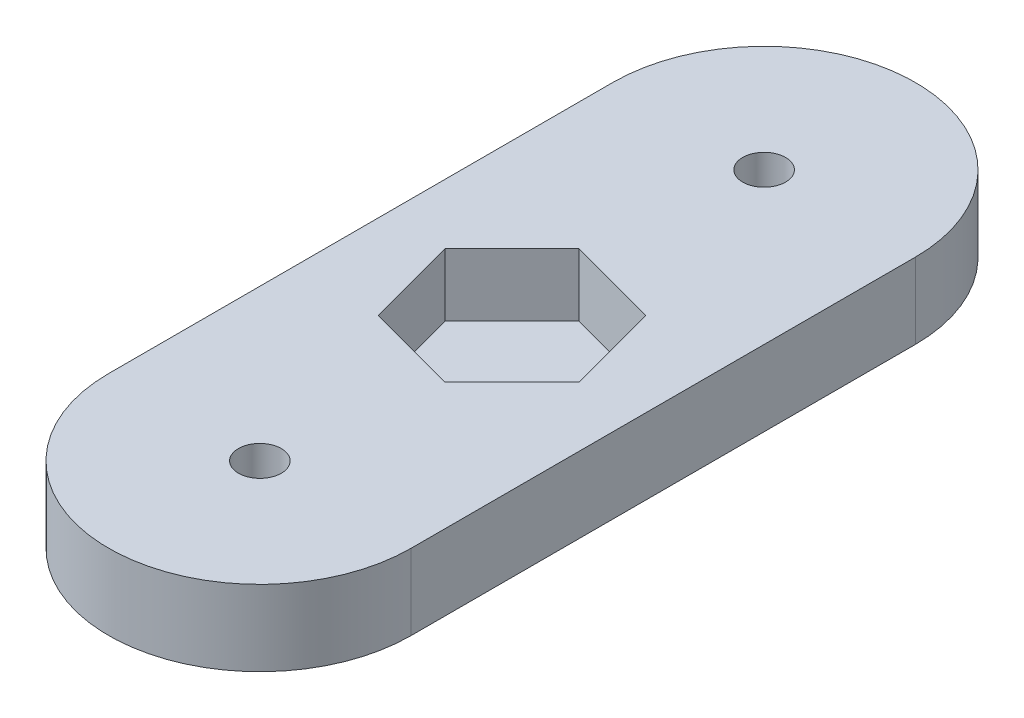
ISO-10303-21;
HEADER;
FILE_DESCRIPTION(('STEP AP214'),'2;1');
FILE_NAME('part.step','',(''),(''),'','','');
FILE_SCHEMA(('AUTOMOTIVE_DESIGN { 1 0 10303 214 1 1 1 1 }'));
ENDSEC;
DATA;
#1=APPLICATION_CONTEXT('core data for automotive mechanical design processes');
#2=APPLICATION_PROTOCOL_DEFINITION('international standard','automotive_design',2000,#1);
#3=PRODUCT_CONTEXT('',#1,'mechanical');
#4=PRODUCT('Part','Part','',(#3));
#5=PRODUCT_RELATED_PRODUCT_CATEGORY('part','',(#4));
#6=PRODUCT_DEFINITION_FORMATION('','',#4);
#7=PRODUCT_DEFINITION_CONTEXT('part definition',#1,'design');
#8=PRODUCT_DEFINITION('design','',#6,#7);
#9=PRODUCT_DEFINITION_SHAPE('','',#8);
#10=(LENGTH_UNIT() NAMED_UNIT(*) SI_UNIT(.MILLI.,.METRE.));
#11=(NAMED_UNIT(*) PLANE_ANGLE_UNIT() SI_UNIT($,.RADIAN.));
#12=(NAMED_UNIT(*) SI_UNIT($,.STERADIAN.) SOLID_ANGLE_UNIT());
#13=UNCERTAINTY_MEASURE_WITH_UNIT(LENGTH_MEASURE(1.E-05),#10,'distance_accuracy_value','');
#14=(GEOMETRIC_REPRESENTATION_CONTEXT(3) GLOBAL_UNCERTAINTY_ASSIGNED_CONTEXT((#13)) GLOBAL_UNIT_ASSIGNED_CONTEXT((#10,
#11,#12)) REPRESENTATION_CONTEXT('',''));
#15=CARTESIAN_POINT('',(0.,0.,0.));
#16=DIRECTION('',(0.,0.,1.));
#17=DIRECTION('',(1.,0.,0.));
#18=AXIS2_PLACEMENT_3D('',#15,#16,#17);
#19=CARTESIAN_POINT('',(0.,6.,0.));
#20=DIRECTION('',(0.,1.,0.));
#21=DIRECTION('',(0.,0.,1.));
#22=AXIS2_PLACEMENT_3D('',#19,#20,#21);
#23=PLANE('',#22);
#24=DIRECTION('',(0.965925826289069,0.,0.258819045102518));
#25=VECTOR('',#24,1.);
#26=CARTESIAN_POINT('',(-5.3072277760302,6.,-14.6927722239698));
#27=LINE('',#26,#25);
#28=CARTESIAN_POINT('',(-5.3072277760302,6.,-14.6927722239698));
#29=VERTEX_POINT('',#28);
#30=CARTESIAN_POINT('',(1.94258018969747,6.,-12.7501920342723));
#31=VERTEX_POINT('',#30);
#32=EDGE_CURVE('E48',#29,#31,#27,.T.);
#33=ORIENTED_EDGE('',*,*,#32,.F.);
#34=DIRECTION('',(0.258819045102524,0.,0.965925826289068));
#35=VECTOR('',#34,1.);
#36=CARTESIAN_POINT('',(-7.24980796572767,6.,-21.9425801896974));
#37=LINE('',#36,#35);
#38=CARTESIAN_POINT('',(-7.24980796572767,6.,-21.9425801896974));
#39=VERTEX_POINT('',#38);
#40=EDGE_CURVE('E140',#39,#29,#37,.T.);
#41=ORIENTED_EDGE('',*,*,#40,.F.);
#42=DIRECTION('',(-0.707106781186545,0.,0.70710678118655));
#43=VECTOR('',#42,1.);
#44=CARTESIAN_POINT('',(-1.94258018969747,6.,-27.2498079657277));
#45=LINE('',#44,#43);
#46=CARTESIAN_POINT('',(-1.94258018969747,6.,-27.2498079657277));
#47=VERTEX_POINT('',#46);
#48=EDGE_CURVE('E143',#47,#39,#45,.T.);
#49=ORIENTED_EDGE('',*,*,#48,.F.);
#50=DIRECTION('',(-0.965925826289069,0.,-0.258819045102518));
#51=VECTOR('',#50,1.);
#52=CARTESIAN_POINT('',(5.3072277760302,6.,-25.3072277760302));
#53=LINE('',#52,#51);
#54=CARTESIAN_POINT('',(5.3072277760302,6.,-25.3072277760302));
#55=VERTEX_POINT('',#54);
#56=EDGE_CURVE('E159',#55,#47,#53,.T.);
#57=ORIENTED_EDGE('',*,*,#56,.F.);
#58=DIRECTION('',(-0.258819045102524,0.,-0.965925826289068));
#59=VECTOR('',#58,1.);
#60=CARTESIAN_POINT('',(7.24980796572767,6.,-18.0574198103026));
#61=LINE('',#60,#59);
#62=CARTESIAN_POINT('',(7.24980796572767,6.,-18.0574198103026));
#63=VERTEX_POINT('',#62);
#64=EDGE_CURVE('E156',#63,#55,#61,.T.);
#65=ORIENTED_EDGE('',*,*,#64,.F.);
#66=DIRECTION('',(0.707106781186546,0.,-0.70710678118655));
#67=VECTOR('',#66,1.);
#68=CARTESIAN_POINT('',(1.94258018969747,6.,-12.7501920342723));
#69=LINE('',#68,#67);
#70=EDGE_CURVE('E154',#31,#63,#69,.T.);
#71=ORIENTED_EDGE('',*,*,#70,.F.);
#72=EDGE_LOOP('',(#33,#41,#49,#57,#65,#71));
#73=FACE_BOUND('',#72,.T.);
#74=CARTESIAN_POINT('',(0.,6.,-40.));
#75=DIRECTION('',(0.,1.,0.));
#76=DIRECTION('',(0.,0.,1.));
#77=AXIS2_PLACEMENT_3D('',#74,#75,#76);
#78=CIRCLE('',#77,1.7);
#79=CARTESIAN_POINT('',(0.,6.,-38.3));
#80=VERTEX_POINT('',#79);
#81=EDGE_CURVE('E180',#80,#80,#78,.T.);
#82=ORIENTED_EDGE('',*,*,#81,.F.);
#83=EDGE_LOOP('',(#82));
#84=FACE_BOUND('',#83,.T.);
#85=CARTESIAN_POINT('',(0.,6.,0.));
#86=DIRECTION('',(0.,1.,0.));
#87=DIRECTION('',(0.,0.,1.));
#88=AXIS2_PLACEMENT_3D('',#85,#86,#87);
#89=CIRCLE('',#88,12.);
#90=CARTESIAN_POINT('',(-12.,6.,0.));
#91=VERTEX_POINT('',#90);
#92=CARTESIAN_POINT('',(12.,6.,0.));
#93=VERTEX_POINT('',#92);
#94=EDGE_CURVE('E186',#91,#93,#89,.T.);
#95=ORIENTED_EDGE('',*,*,#94,.T.);
#96=DIRECTION('',(0.,0.,-1.));
#97=VECTOR('',#96,1.);
#98=CARTESIAN_POINT('',(12.,6.,0.));
#99=LINE('',#98,#97);
#100=CARTESIAN_POINT('',(12.,6.,-40.));
#101=VERTEX_POINT('',#100);
#102=EDGE_CURVE('E85',#93,#101,#99,.T.);
#103=ORIENTED_EDGE('',*,*,#102,.T.);
#104=CARTESIAN_POINT('',(0.,6.,-40.));
#105=DIRECTION('',(0.,1.,0.));
#106=DIRECTION('',(0.,0.,1.));
#107=AXIS2_PLACEMENT_3D('',#104,#105,#106);
#108=CIRCLE('',#107,12.);
#109=CARTESIAN_POINT('',(-12.,6.,-40.));
#110=VERTEX_POINT('',#109);
#111=EDGE_CURVE('E189',#101,#110,#108,.T.);
#112=ORIENTED_EDGE('',*,*,#111,.T.);
#113=DIRECTION('',(0.,0.,1.));
#114=VECTOR('',#113,1.);
#115=CARTESIAN_POINT('',(-12.,6.,0.));
#116=LINE('',#115,#114);
#117=EDGE_CURVE('E57',#110,#91,#116,.T.);
#118=ORIENTED_EDGE('',*,*,#117,.T.);
#119=EDGE_LOOP('',(#95,#103,#112,#118));
#120=FACE_BOUND('',#119,.T.);
#121=CARTESIAN_POINT('',(0.,6.,0.));
#122=DIRECTION('',(0.,1.,0.));
#123=DIRECTION('',(0.,0.,1.));
#124=AXIS2_PLACEMENT_3D('',#121,#122,#123);
#125=CIRCLE('',#124,1.7);
#126=CARTESIAN_POINT('',(0.,6.,1.7));
#127=VERTEX_POINT('',#126);
#128=EDGE_CURVE('E174',#127,#127,#125,.T.);
#129=ORIENTED_EDGE('',*,*,#128,.F.);
#130=EDGE_LOOP('',(#129));
#131=FACE_BOUND('',#130,.T.);
#132=ADVANCED_FACE('F33',(#73,#84,#120,#131),#23,.T.);
#133=CARTESIAN_POINT('',(0.,0.,0.));
#134=DIRECTION('',(0.,1.,0.));
#135=DIRECTION('',(0.,0.,1.));
#136=AXIS2_PLACEMENT_3D('',#133,#134,#135);
#137=PLANE('',#136);
#138=CARTESIAN_POINT('',(0.,0.,-40.));
#139=DIRECTION('',(0.,1.,0.));
#140=DIRECTION('',(0.,0.,1.));
#141=AXIS2_PLACEMENT_3D('',#138,#139,#140);
#142=CIRCLE('',#141,1.7);
#143=CARTESIAN_POINT('',(0.,0.,-38.3));
#144=VERTEX_POINT('',#143);
#145=EDGE_CURVE('E177',#144,#144,#142,.T.);
#146=ORIENTED_EDGE('',*,*,#145,.T.);
#147=EDGE_LOOP('',(#146));
#148=FACE_BOUND('',#147,.T.);
#149=CARTESIAN_POINT('',(0.,0.,0.));
#150=DIRECTION('',(0.,1.,0.));
#151=DIRECTION('',(0.,0.,1.));
#152=AXIS2_PLACEMENT_3D('',#149,#150,#151);
#153=CIRCLE('',#152,12.);
#154=CARTESIAN_POINT('',(-12.,0.,0.));
#155=VERTEX_POINT('',#154);
#156=CARTESIAN_POINT('',(12.,0.,0.));
#157=VERTEX_POINT('',#156);
#158=EDGE_CURVE('E183',#155,#157,#153,.T.);
#159=ORIENTED_EDGE('',*,*,#158,.F.);
#160=DIRECTION('',(0.,0.,1.));
#161=VECTOR('',#160,1.);
#162=CARTESIAN_POINT('',(-12.,0.,0.));
#163=LINE('',#162,#161);
#164=CARTESIAN_POINT('',(-12.,0.,-40.));
#165=VERTEX_POINT('',#164);
#166=EDGE_CURVE('E78',#165,#155,#163,.T.);
#167=ORIENTED_EDGE('',*,*,#166,.F.);
#168=CARTESIAN_POINT('',(0.,0.,-40.));
#169=DIRECTION('',(0.,1.,0.));
#170=DIRECTION('',(0.,0.,1.));
#171=AXIS2_PLACEMENT_3D('',#168,#169,#170);
#172=CIRCLE('',#171,12.);
#173=CARTESIAN_POINT('',(12.,0.,-40.));
#174=VERTEX_POINT('',#173);
#175=EDGE_CURVE('E197',#174,#165,#172,.T.);
#176=ORIENTED_EDGE('',*,*,#175,.F.);
#177=DIRECTION('',(0.,0.,-1.));
#178=VECTOR('',#177,1.);
#179=CARTESIAN_POINT('',(12.,0.,0.));
#180=LINE('',#179,#178);
#181=EDGE_CURVE('E195',#157,#174,#180,.T.);
#182=ORIENTED_EDGE('',*,*,#181,.F.);
#183=EDGE_LOOP('',(#159,#167,#176,#182));
#184=FACE_BOUND('',#183,.T.);
#185=CARTESIAN_POINT('',(0.,0.,0.));
#186=DIRECTION('',(0.,1.,0.));
#187=DIRECTION('',(0.,0.,1.));
#188=AXIS2_PLACEMENT_3D('',#185,#186,#187);
#189=CIRCLE('',#188,1.7);
#190=CARTESIAN_POINT('',(0.,0.,1.7));
#191=VERTEX_POINT('',#190);
#192=EDGE_CURVE('E166',#191,#191,#189,.T.);
#193=ORIENTED_EDGE('',*,*,#192,.T.);
#194=EDGE_LOOP('',(#193));
#195=FACE_BOUND('',#194,.T.);
#196=ADVANCED_FACE('F210',(#148,#184,#195),#137,.F.);
#197=CARTESIAN_POINT('',(0.,6.,0.));
#198=DIRECTION('',(0.,-1.,0.));
#199=DIRECTION('',(0.,0.,-1.));
#200=AXIS2_PLACEMENT_3D('',#197,#198,#199);
#201=CYLINDRICAL_SURFACE('',#200,12.);
#202=ORIENTED_EDGE('',*,*,#158,.T.);
#203=DIRECTION('',(0.,-1.,0.));
#204=VECTOR('',#203,1.);
#205=CARTESIAN_POINT('',(12.,6.,0.));
#206=LINE('',#205,#204);
#207=EDGE_CURVE('E11',#93,#157,#206,.T.);
#208=ORIENTED_EDGE('',*,*,#207,.F.);
#209=ORIENTED_EDGE('',*,*,#94,.F.);
#210=DIRECTION('',(0.,-1.,0.));
#211=VECTOR('',#210,1.);
#212=CARTESIAN_POINT('',(-12.,6.,0.));
#213=LINE('',#212,#211);
#214=EDGE_CURVE('E192',#91,#155,#213,.T.);
#215=ORIENTED_EDGE('',*,*,#214,.T.);
#216=EDGE_LOOP('',(#202,#208,#209,#215));
#217=FACE_BOUND('',#216,.T.);
#218=ADVANCED_FACE('F35',(#217),#201,.T.);
#219=CARTESIAN_POINT('',(12.,6.,0.));
#220=DIRECTION('',(-1.,0.,0.));
#221=DIRECTION('',(0.,0.,1.));
#222=AXIS2_PLACEMENT_3D('',#219,#220,#221);
#223=PLANE('',#222);
#224=ORIENTED_EDGE('',*,*,#181,.T.);
#225=DIRECTION('',(0.,-1.,0.));
#226=VECTOR('',#225,1.);
#227=CARTESIAN_POINT('',(12.,6.,-40.));
#228=LINE('',#227,#226);
#229=EDGE_CURVE('E41',#101,#174,#228,.T.);
#230=ORIENTED_EDGE('',*,*,#229,.F.);
#231=ORIENTED_EDGE('',*,*,#102,.F.);
#232=ORIENTED_EDGE('',*,*,#207,.T.);
#233=EDGE_LOOP('',(#224,#230,#231,#232));
#234=FACE_BOUND('',#233,.T.);
#235=ADVANCED_FACE('F226',(#234),#223,.F.);
#236=CARTESIAN_POINT('',(0.,6.,-40.));
#237=DIRECTION('',(0.,-1.,0.));
#238=DIRECTION('',(0.,0.,-1.));
#239=AXIS2_PLACEMENT_3D('',#236,#237,#238);
#240=CYLINDRICAL_SURFACE('',#239,12.);
#241=ORIENTED_EDGE('',*,*,#175,.T.);
#242=DIRECTION('',(0.,-1.,0.));
#243=VECTOR('',#242,1.);
#244=CARTESIAN_POINT('',(-12.,6.,-40.));
#245=LINE('',#244,#243);
#246=EDGE_CURVE('E201',#110,#165,#245,.T.);
#247=ORIENTED_EDGE('',*,*,#246,.F.);
#248=ORIENTED_EDGE('',*,*,#111,.F.);
#249=ORIENTED_EDGE('',*,*,#229,.T.);
#250=EDGE_LOOP('',(#241,#247,#248,#249));
#251=FACE_BOUND('',#250,.T.);
#252=ADVANCED_FACE('F206',(#251),#240,.T.);
#253=CARTESIAN_POINT('',(-12.,6.,0.));
#254=DIRECTION('',(1.,0.,0.));
#255=DIRECTION('',(0.,0.,-1.));
#256=AXIS2_PLACEMENT_3D('',#253,#254,#255);
#257=PLANE('',#256);
#258=ORIENTED_EDGE('',*,*,#166,.T.);
#259=ORIENTED_EDGE('',*,*,#214,.F.);
#260=ORIENTED_EDGE('',*,*,#117,.F.);
#261=ORIENTED_EDGE('',*,*,#246,.T.);
#262=EDGE_LOOP('',(#258,#259,#260,#261));
#263=FACE_BOUND('',#262,.T.);
#264=ADVANCED_FACE('F215',(#263),#257,.F.);
#265=CARTESIAN_POINT('',(0.,6.,-40.));
#266=DIRECTION('',(0.,-1.,0.));
#267=DIRECTION('',(0.,0.,-1.));
#268=AXIS2_PLACEMENT_3D('',#265,#266,#267);
#269=CYLINDRICAL_SURFACE('',#268,1.7);
#270=ORIENTED_EDGE('',*,*,#81,.T.);
#271=EDGE_LOOP('',(#270));
#272=FACE_BOUND('',#271,.T.);
#273=ORIENTED_EDGE('',*,*,#145,.F.);
#274=EDGE_LOOP('',(#273));
#275=FACE_BOUND('',#274,.T.);
#276=ADVANCED_FACE('F217',(#272,#275),#269,.F.);
#277=CARTESIAN_POINT('',(0.,6.,0.));
#278=DIRECTION('',(0.,-1.,0.));
#279=DIRECTION('',(0.,0.,-1.));
#280=AXIS2_PLACEMENT_3D('',#277,#278,#279);
#281=CYLINDRICAL_SURFACE('',#280,1.7);
#282=ORIENTED_EDGE('',*,*,#128,.T.);
#283=EDGE_LOOP('',(#282));
#284=FACE_BOUND('',#283,.T.);
#285=ORIENTED_EDGE('',*,*,#192,.F.);
#286=EDGE_LOOP('',(#285));
#287=FACE_BOUND('',#286,.T.);
#288=ADVANCED_FACE('F223',(#284,#287),#281,.F.);
#289=CARTESIAN_POINT('',(-5.3072277760302,1.,-14.6927722239698));
#290=DIRECTION('',(-0.258819045102518,0.,0.965925826289069));
#291=DIRECTION('',(0.965925826289069,0.,0.258819045102518));
#292=AXIS2_PLACEMENT_3D('',#289,#290,#291);
#293=PLANE('',#292);
#294=ORIENTED_EDGE('',*,*,#32,.T.);
#295=DIRECTION('',(0.,1.,0.));
#296=VECTOR('',#295,1.);
#297=CARTESIAN_POINT('',(1.94258018969747,1.,-12.7501920342723));
#298=LINE('',#297,#296);
#299=CARTESIAN_POINT('',(1.94258018969747,1.,-12.7501920342723));
#300=VERTEX_POINT('',#299);
#301=EDGE_CURVE('E117',#300,#31,#298,.T.);
#302=ORIENTED_EDGE('',*,*,#301,.F.);
#303=DIRECTION('',(0.965925826289069,0.,0.258819045102518));
#304=VECTOR('',#303,1.);
#305=CARTESIAN_POINT('',(-5.3072277760302,1.,-14.6927722239698));
#306=LINE('',#305,#304);
#307=CARTESIAN_POINT('',(-5.3072277760302,1.,-14.6927722239698));
#308=VERTEX_POINT('',#307);
#309=EDGE_CURVE('E121',#308,#300,#306,.T.);
#310=ORIENTED_EDGE('',*,*,#309,.F.);
#311=DIRECTION('',(0.,1.,0.));
#312=VECTOR('',#311,1.);
#313=CARTESIAN_POINT('',(-5.3072277760302,1.,-14.6927722239698));
#314=LINE('',#313,#312);
#315=EDGE_CURVE('E164',#308,#29,#314,.T.);
#316=ORIENTED_EDGE('',*,*,#315,.T.);
#317=EDGE_LOOP('',(#294,#302,#310,#316));
#318=FACE_BOUND('',#317,.T.);
#319=ADVANCED_FACE('F119',(#318),#293,.F.);
#320=CARTESIAN_POINT('',(-7.24980796572767,1.,-21.9425801896974));
#321=DIRECTION('',(-0.965925826289068,0.,0.258819045102524));
#322=DIRECTION('',(0.258819045102524,0.,0.965925826289068));
#323=AXIS2_PLACEMENT_3D('',#320,#321,#322);
#324=PLANE('',#323);
#325=ORIENTED_EDGE('',*,*,#40,.T.);
#326=ORIENTED_EDGE('',*,*,#315,.F.);
#327=DIRECTION('',(0.258819045102524,0.,0.965925826289068));
#328=VECTOR('',#327,1.);
#329=CARTESIAN_POINT('',(-7.24980796572767,1.,-21.9425801896974));
#330=LINE('',#329,#328);
#331=CARTESIAN_POINT('',(-7.24980796572767,1.,-21.9425801896974));
#332=VERTEX_POINT('',#331);
#333=EDGE_CURVE('E127',#332,#308,#330,.T.);
#334=ORIENTED_EDGE('',*,*,#333,.F.);
#335=DIRECTION('',(0.,1.,0.));
#336=VECTOR('',#335,1.);
#337=CARTESIAN_POINT('',(-7.24980796572767,1.,-21.9425801896974));
#338=LINE('',#337,#336);
#339=EDGE_CURVE('E167',#332,#39,#338,.T.);
#340=ORIENTED_EDGE('',*,*,#339,.T.);
#341=EDGE_LOOP('',(#325,#326,#334,#340));
#342=FACE_BOUND('',#341,.T.);
#343=ADVANCED_FACE('F243',(#342),#324,.F.);
#344=CARTESIAN_POINT('',(-1.94258018969747,1.,-27.2498079657277));
#345=DIRECTION('',(-0.70710678118655,0.,-0.707106781186545));
#346=DIRECTION('',(-0.707106781186545,0.,0.70710678118655));
#347=AXIS2_PLACEMENT_3D('',#344,#345,#346);
#348=PLANE('',#347);
#349=ORIENTED_EDGE('',*,*,#48,.T.);
#350=ORIENTED_EDGE('',*,*,#339,.F.);
#351=DIRECTION('',(-0.707106781186545,0.,0.70710678118655));
#352=VECTOR('',#351,1.);
#353=CARTESIAN_POINT('',(-1.94258018969747,1.,-27.2498079657277));
#354=LINE('',#353,#352);
#355=CARTESIAN_POINT('',(-1.94258018969747,1.,-27.2498079657277));
#356=VERTEX_POINT('',#355);
#357=EDGE_CURVE('E150',#356,#332,#354,.T.);
#358=ORIENTED_EDGE('',*,*,#357,.F.);
#359=DIRECTION('',(0.,1.,0.));
#360=VECTOR('',#359,1.);
#361=CARTESIAN_POINT('',(-1.94258018969747,1.,-27.2498079657277));
#362=LINE('',#361,#360);
#363=EDGE_CURVE('E169',#356,#47,#362,.T.);
#364=ORIENTED_EDGE('',*,*,#363,.T.);
#365=EDGE_LOOP('',(#349,#350,#358,#364));
#366=FACE_BOUND('',#365,.T.);
#367=ADVANCED_FACE('F253',(#366),#348,.F.);
#368=CARTESIAN_POINT('',(5.3072277760302,1.,-25.3072277760302));
#369=DIRECTION('',(0.258819045102518,0.,-0.965925826289069));
#370=DIRECTION('',(-0.965925826289069,0.,-0.258819045102518));
#371=AXIS2_PLACEMENT_3D('',#368,#369,#370);
#372=PLANE('',#371);
#373=ORIENTED_EDGE('',*,*,#56,.T.);
#374=ORIENTED_EDGE('',*,*,#363,.F.);
#375=DIRECTION('',(-0.965925826289069,0.,-0.258819045102518));
#376=VECTOR('',#375,1.);
#377=CARTESIAN_POINT('',(5.3072277760302,1.,-25.3072277760302));
#378=LINE('',#377,#376);
#379=CARTESIAN_POINT('',(5.3072277760302,1.,-25.3072277760302));
#380=VERTEX_POINT('',#379);
#381=EDGE_CURVE('E147',#380,#356,#378,.T.);
#382=ORIENTED_EDGE('',*,*,#381,.F.);
#383=DIRECTION('',(0.,1.,0.));
#384=VECTOR('',#383,1.);
#385=CARTESIAN_POINT('',(5.3072277760302,1.,-25.3072277760302));
#386=LINE('',#385,#384);
#387=EDGE_CURVE('E171',#380,#55,#386,.T.);
#388=ORIENTED_EDGE('',*,*,#387,.T.);
#389=EDGE_LOOP('',(#373,#374,#382,#388));
#390=FACE_BOUND('',#389,.T.);
#391=ADVANCED_FACE('F249',(#390),#372,.F.);
#392=CARTESIAN_POINT('',(7.24980796572767,1.,-18.0574198103026));
#393=DIRECTION('',(0.965925826289068,0.,-0.258819045102524));
#394=DIRECTION('',(-0.258819045102524,0.,-0.965925826289068));
#395=AXIS2_PLACEMENT_3D('',#392,#393,#394);
#396=PLANE('',#395);
#397=ORIENTED_EDGE('',*,*,#64,.T.);
#398=ORIENTED_EDGE('',*,*,#387,.F.);
#399=DIRECTION('',(-0.258819045102524,0.,-0.965925826289068));
#400=VECTOR('',#399,1.);
#401=CARTESIAN_POINT('',(7.24980796572767,1.,-18.0574198103026));
#402=LINE('',#401,#400);
#403=CARTESIAN_POINT('',(7.24980796572767,1.,-18.0574198103026));
#404=VERTEX_POINT('',#403);
#405=EDGE_CURVE('E135',#404,#380,#402,.T.);
#406=ORIENTED_EDGE('',*,*,#405,.F.);
#407=DIRECTION('',(0.,1.,0.));
#408=VECTOR('',#407,1.);
#409=CARTESIAN_POINT('',(7.24980796572767,1.,-18.0574198103026));
#410=LINE('',#409,#408);
#411=EDGE_CURVE('E126',#404,#63,#410,.T.);
#412=ORIENTED_EDGE('',*,*,#411,.T.);
#413=EDGE_LOOP('',(#397,#398,#406,#412));
#414=FACE_BOUND('',#413,.T.);
#415=ADVANCED_FACE('F246',(#414),#396,.F.);
#416=CARTESIAN_POINT('',(1.94258018969747,1.,-12.7501920342723));
#417=DIRECTION('',(0.70710678118655,0.,0.707106781186546));
#418=DIRECTION('',(0.707106781186546,0.,-0.70710678118655));
#419=AXIS2_PLACEMENT_3D('',#416,#417,#418);
#420=PLANE('',#419);
#421=ORIENTED_EDGE('',*,*,#70,.T.);
#422=ORIENTED_EDGE('',*,*,#411,.F.);
#423=DIRECTION('',(0.707106781186546,0.,-0.70710678118655));
#424=VECTOR('',#423,1.);
#425=CARTESIAN_POINT('',(1.94258018969747,1.,-12.7501920342723));
#426=LINE('',#425,#424);
#427=EDGE_CURVE('E130',#300,#404,#426,.T.);
#428=ORIENTED_EDGE('',*,*,#427,.F.);
#429=ORIENTED_EDGE('',*,*,#301,.T.);
#430=EDGE_LOOP('',(#421,#422,#428,#429));
#431=FACE_BOUND('',#430,.T.);
#432=ADVANCED_FACE('F131',(#431),#420,.F.);
#433=CARTESIAN_POINT('',(0.,1.,0.));
#434=DIRECTION('',(0.,1.,0.));
#435=DIRECTION('',(0.,0.,1.));
#436=AXIS2_PLACEMENT_3D('',#433,#434,#435);
#437=PLANE('',#436);
#438=ORIENTED_EDGE('',*,*,#309,.T.);
#439=ORIENTED_EDGE('',*,*,#427,.T.);
#440=ORIENTED_EDGE('',*,*,#405,.T.);
#441=ORIENTED_EDGE('',*,*,#381,.T.);
#442=ORIENTED_EDGE('',*,*,#357,.T.);
#443=ORIENTED_EDGE('',*,*,#333,.T.);
#444=EDGE_LOOP('',(#438,#439,#440,#441,#442,#443));
#445=FACE_BOUND('',#444,.T.);
#446=ADVANCED_FACE('F137',(#445),#437,.T.);
#447=CLOSED_SHELL('',(#132,#196,#218,#235,#252,#264,#276,#288,#319,#343,#367,#391,#415,#432,#446));
#448=MANIFOLD_SOLID_BREP('B2',#447);
#449=ADVANCED_BREP_SHAPE_REPRESENTATION('',(#18,#448),#14);
#450=SHAPE_DEFINITION_REPRESENTATION(#9,#449);
ENDSEC;
END-ISO-10303-21;
